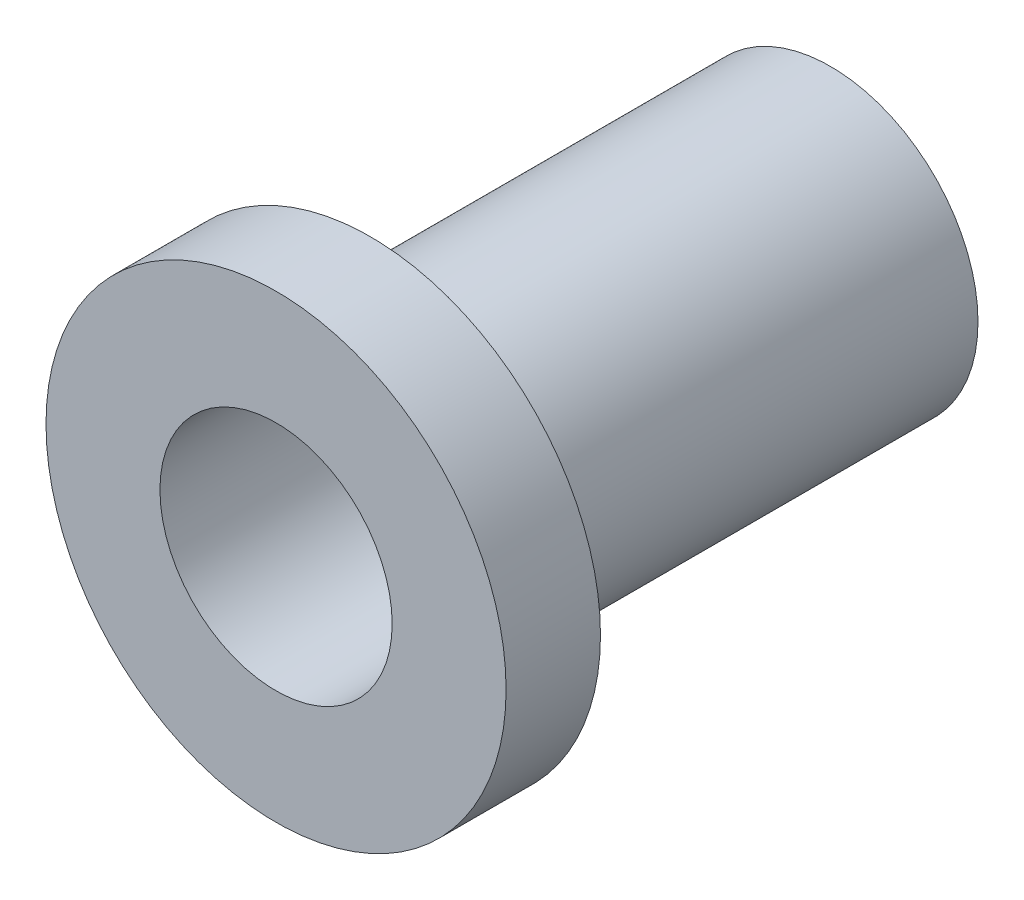
ISO-10303-21;
HEADER;
FILE_DESCRIPTION(('STEP AP214'),'2;1');
FILE_NAME('part.step','',(''),(''),'','','');
FILE_SCHEMA(('AUTOMOTIVE_DESIGN { 1 0 10303 214 1 1 1 1 }'));
ENDSEC;
DATA;
#1=APPLICATION_CONTEXT('core data for automotive mechanical design processes');
#2=APPLICATION_PROTOCOL_DEFINITION('international standard','automotive_design',2000,#1);
#3=PRODUCT_CONTEXT('',#1,'mechanical');
#4=PRODUCT('Part','Part','',(#3));
#5=PRODUCT_RELATED_PRODUCT_CATEGORY('part','',(#4));
#6=PRODUCT_DEFINITION_FORMATION('','',#4);
#7=PRODUCT_DEFINITION_CONTEXT('part definition',#1,'design');
#8=PRODUCT_DEFINITION('design','',#6,#7);
#9=PRODUCT_DEFINITION_SHAPE('','',#8);
#10=(LENGTH_UNIT() NAMED_UNIT(*) SI_UNIT(.MILLI.,.METRE.));
#11=(NAMED_UNIT(*) PLANE_ANGLE_UNIT() SI_UNIT($,.RADIAN.));
#12=(NAMED_UNIT(*) SI_UNIT($,.STERADIAN.) SOLID_ANGLE_UNIT());
#13=UNCERTAINTY_MEASURE_WITH_UNIT(LENGTH_MEASURE(1.E-05),#10,'distance_accuracy_value','');
#14=(GEOMETRIC_REPRESENTATION_CONTEXT(3) GLOBAL_UNCERTAINTY_ASSIGNED_CONTEXT((#13)) GLOBAL_UNIT_ASSIGNED_CONTEXT((#10,
#11,#12)) REPRESENTATION_CONTEXT('',''));
#15=CARTESIAN_POINT('',(0.,0.,0.));
#16=DIRECTION('',(0.,0.,1.));
#17=DIRECTION('',(1.,0.,0.));
#18=AXIS2_PLACEMENT_3D('',#15,#16,#17);
#19=CARTESIAN_POINT('',(0.,0.,2.032));
#20=DIRECTION('',(0.,0.,1.));
#21=DIRECTION('',(1.,0.,0.));
#22=AXIS2_PLACEMENT_3D('',#19,#20,#21);
#23=PLANE('',#22);
#24=CARTESIAN_POINT('',(0.,0.,2.032));
#25=DIRECTION('',(0.,0.,-1.));
#26=DIRECTION('',(-1.,0.,0.));
#27=AXIS2_PLACEMENT_3D('',#24,#25,#26);
#28=CIRCLE('',#27,2.5);
#29=CARTESIAN_POINT('',(-2.5,0.,2.032));
#30=VERTEX_POINT('',#29);
#31=EDGE_CURVE('E26',#30,#30,#28,.T.);
#32=ORIENTED_EDGE('',*,*,#31,.T.);
#33=EDGE_LOOP('',(#32));
#34=FACE_BOUND('',#33,.T.);
#35=CARTESIAN_POINT('',(0.,0.,2.032));
#36=DIRECTION('',(0.,0.,-1.));
#37=DIRECTION('',(-1.,0.,0.));
#38=AXIS2_PLACEMENT_3D('',#35,#36,#37);
#39=CIRCLE('',#38,4.953);
#40=CARTESIAN_POINT('',(-4.953,0.,2.032));
#41=VERTEX_POINT('',#40);
#42=EDGE_CURVE('E42',#41,#41,#39,.T.);
#43=ORIENTED_EDGE('',*,*,#42,.F.);
#44=EDGE_LOOP('',(#43));
#45=FACE_BOUND('',#44,.T.);
#46=ADVANCED_FACE('F23',(#34,#45),#23,.T.);
#47=CARTESIAN_POINT('',(0.,0.,2.032));
#48=DIRECTION('',(0.,0.,-1.));
#49=DIRECTION('',(-1.,0.,0.));
#50=AXIS2_PLACEMENT_3D('',#47,#48,#49);
#51=CYLINDRICAL_SURFACE('',#50,2.5);
#52=CARTESIAN_POINT('',(0.,0.,-9.906));
#53=DIRECTION('',(0.,0.,-1.));
#54=DIRECTION('',(-1.,0.,0.));
#55=AXIS2_PLACEMENT_3D('',#52,#53,#54);
#56=CIRCLE('',#55,2.5);
#57=CARTESIAN_POINT('',(-2.5,0.,-9.906));
#58=VERTEX_POINT('',#57);
#59=EDGE_CURVE('E40',#58,#58,#56,.F.);
#60=ORIENTED_EDGE('',*,*,#59,.F.);
#61=EDGE_LOOP('',(#60));
#62=FACE_BOUND('',#61,.T.);
#63=ORIENTED_EDGE('',*,*,#31,.F.);
#64=EDGE_LOOP('',(#63));
#65=FACE_BOUND('',#64,.T.);
#66=ADVANCED_FACE('F51',(#62,#65),#51,.F.);
#67=CARTESIAN_POINT('',(0.,0.,2.032));
#68=DIRECTION('',(0.,0.,-1.));
#69=DIRECTION('',(-1.,0.,0.));
#70=AXIS2_PLACEMENT_3D('',#67,#68,#69);
#71=CYLINDRICAL_SURFACE('',#70,4.953);
#72=ORIENTED_EDGE('',*,*,#42,.T.);
#73=EDGE_LOOP('',(#72));
#74=FACE_BOUND('',#73,.T.);
#75=CARTESIAN_POINT('',(0.,0.,0.));
#76=DIRECTION('',(0.,0.,-1.));
#77=DIRECTION('',(-1.,0.,0.));
#78=AXIS2_PLACEMENT_3D('',#75,#76,#77);
#79=CIRCLE('',#78,4.953);
#80=CARTESIAN_POINT('',(-4.953,0.,0.));
#81=VERTEX_POINT('',#80);
#82=EDGE_CURVE('E35',#81,#81,#79,.F.);
#83=ORIENTED_EDGE('',*,*,#82,.T.);
#84=EDGE_LOOP('',(#83));
#85=FACE_BOUND('',#84,.T.);
#86=ADVANCED_FACE('F53',(#74,#85),#71,.T.);
#87=CARTESIAN_POINT('',(0.,0.,-9.906));
#88=DIRECTION('',(0.,0.,-1.));
#89=DIRECTION('',(-1.,0.,0.));
#90=AXIS2_PLACEMENT_3D('',#87,#88,#89);
#91=PLANE('',#90);
#92=ORIENTED_EDGE('',*,*,#59,.T.);
#93=EDGE_LOOP('',(#92));
#94=FACE_BOUND('',#93,.T.);
#95=CARTESIAN_POINT('',(0.,0.,-9.906));
#96=DIRECTION('',(0.,0.,1.));
#97=DIRECTION('',(1.,0.,0.));
#98=AXIS2_PLACEMENT_3D('',#95,#96,#97);
#99=CIRCLE('',#98,3.175);
#100=CARTESIAN_POINT('',(3.175,0.,-9.906));
#101=VERTEX_POINT('',#100);
#102=EDGE_CURVE('E30',#101,#101,#99,.T.);
#103=ORIENTED_EDGE('',*,*,#102,.F.);
#104=EDGE_LOOP('',(#103));
#105=FACE_BOUND('',#104,.T.);
#106=ADVANCED_FACE('F60',(#94,#105),#91,.T.);
#107=CARTESIAN_POINT('',(0.,0.,0.));
#108=DIRECTION('',(0.,0.,1.));
#109=DIRECTION('',(1.,0.,0.));
#110=AXIS2_PLACEMENT_3D('',#107,#108,#109);
#111=PLANE('',#110);
#112=CARTESIAN_POINT('',(0.,0.,0.));
#113=DIRECTION('',(0.,0.,1.));
#114=DIRECTION('',(1.,0.,0.));
#115=AXIS2_PLACEMENT_3D('',#112,#113,#114);
#116=CIRCLE('',#115,3.175);
#117=CARTESIAN_POINT('',(3.175,0.,0.));
#118=VERTEX_POINT('',#117);
#119=EDGE_CURVE('E12',#118,#118,#116,.F.);
#120=ORIENTED_EDGE('',*,*,#119,.F.);
#121=EDGE_LOOP('',(#120));
#122=FACE_BOUND('',#121,.T.);
#123=ORIENTED_EDGE('',*,*,#82,.F.);
#124=EDGE_LOOP('',(#123));
#125=FACE_BOUND('',#124,.T.);
#126=ADVANCED_FACE('F65',(#122,#125),#111,.F.);
#127=CARTESIAN_POINT('',(0.,0.,-9.906));
#128=DIRECTION('',(0.,0.,1.));
#129=DIRECTION('',(1.,0.,0.));
#130=AXIS2_PLACEMENT_3D('',#127,#128,#129);
#131=CYLINDRICAL_SURFACE('',#130,3.175);
#132=ORIENTED_EDGE('',*,*,#119,.T.);
#133=EDGE_LOOP('',(#132));
#134=FACE_BOUND('',#133,.T.);
#135=ORIENTED_EDGE('',*,*,#102,.T.);
#136=EDGE_LOOP('',(#135));
#137=FACE_BOUND('',#136,.T.);
#138=ADVANCED_FACE('F63',(#134,#137),#131,.T.);
#139=CLOSED_SHELL('',(#46,#66,#86,#106,#126,#138));
#140=MANIFOLD_SOLID_BREP('B1',#139);
#141=ADVANCED_BREP_SHAPE_REPRESENTATION('',(#18,#140),#14);
#142=SHAPE_DEFINITION_REPRESENTATION(#9,#141);
ENDSEC;
END-ISO-10303-21;
